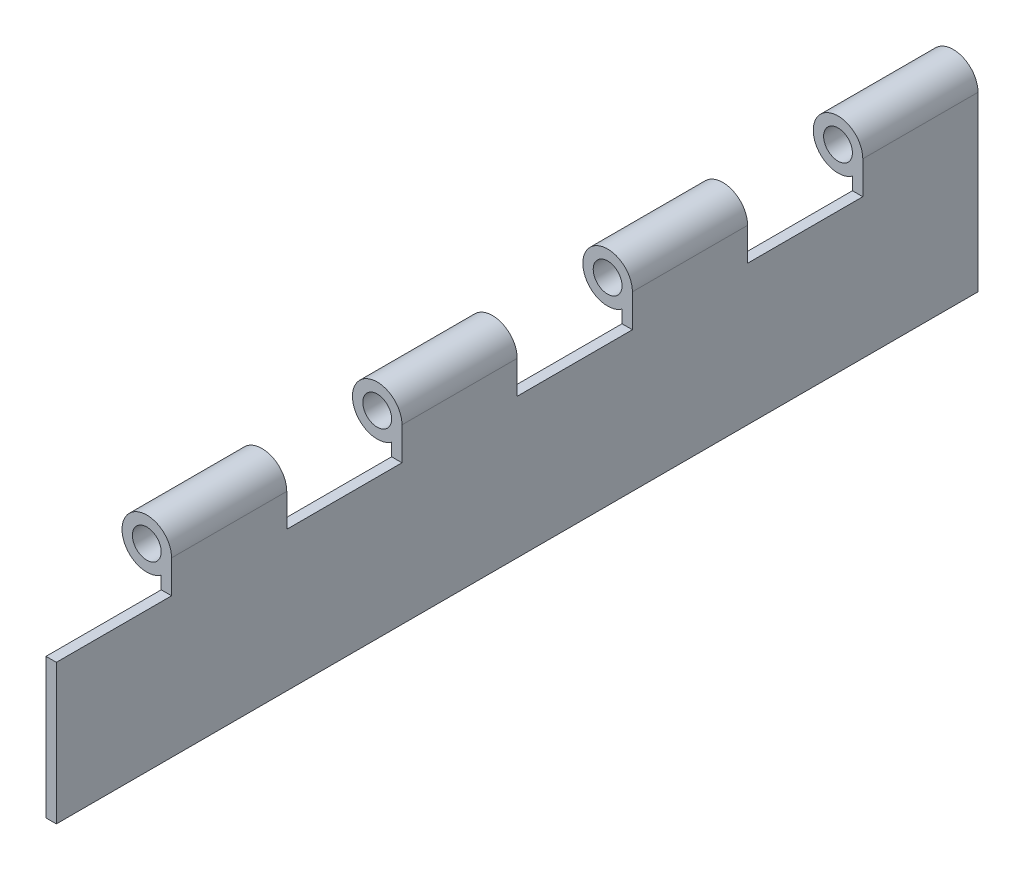
ISO-10303-21;
HEADER;
FILE_DESCRIPTION(('STEP AP214'),'2;1');
FILE_NAME('part.step','',(''),(''),'','','');
FILE_SCHEMA(('AUTOMOTIVE_DESIGN { 1 0 10303 214 1 1 1 1 }'));
ENDSEC;
DATA;
#1=APPLICATION_CONTEXT('core data for automotive mechanical design processes');
#2=APPLICATION_PROTOCOL_DEFINITION('international standard','automotive_design',2000,#1);
#3=PRODUCT_CONTEXT('',#1,'mechanical');
#4=PRODUCT('Part','Part','',(#3));
#5=PRODUCT_RELATED_PRODUCT_CATEGORY('part','',(#4));
#6=PRODUCT_DEFINITION_FORMATION('','',#4);
#7=PRODUCT_DEFINITION_CONTEXT('part definition',#1,'design');
#8=PRODUCT_DEFINITION('design','',#6,#7);
#9=PRODUCT_DEFINITION_SHAPE('','',#8);
#10=(LENGTH_UNIT() NAMED_UNIT(*) SI_UNIT(.MILLI.,.METRE.));
#11=(NAMED_UNIT(*) PLANE_ANGLE_UNIT() SI_UNIT($,.RADIAN.));
#12=(NAMED_UNIT(*) SI_UNIT($,.STERADIAN.) SOLID_ANGLE_UNIT());
#13=UNCERTAINTY_MEASURE_WITH_UNIT(LENGTH_MEASURE(1.E-05),#10,'distance_accuracy_value','');
#14=(GEOMETRIC_REPRESENTATION_CONTEXT(3) GLOBAL_UNCERTAINTY_ASSIGNED_CONTEXT((#13)) GLOBAL_UNIT_ASSIGNED_CONTEXT((#10,
#11,#12)) REPRESENTATION_CONTEXT('',''));
#15=CARTESIAN_POINT('',(0.,0.,0.));
#16=DIRECTION('',(0.,0.,1.));
#17=DIRECTION('',(1.,0.,0.));
#18=AXIS2_PLACEMENT_3D('',#15,#16,#17);
#19=CARTESIAN_POINT('',(0.,0.,203.2));
#20=DIRECTION('',(0.,0.,-1.));
#21=DIRECTION('',(-1.,0.,0.));
#22=AXIS2_PLACEMENT_3D('',#19,#20,#21);
#23=CYLINDRICAL_SURFACE('',#22,5.461);
#24=DIRECTION('',(0.,0.,-1.));
#25=VECTOR('',#24,1.);
#26=CARTESIAN_POINT('',(5.461,0.,203.2));
#27=LINE('',#26,#25);
#28=CARTESIAN_POINT('',(5.461,0.,177.8));
#29=VERTEX_POINT('',#28);
#30=CARTESIAN_POINT('',(5.461,0.,152.4));
#31=VERTEX_POINT('',#30);
#32=EDGE_CURVE('E294',#29,#31,#27,.T.);
#33=ORIENTED_EDGE('',*,*,#32,.T.);
#34=CARTESIAN_POINT('',(0.,0.,152.4));
#35=DIRECTION('',(0.,0.,1.));
#36=DIRECTION('',(1.,0.,0.));
#37=AXIS2_PLACEMENT_3D('',#34,#35,#36);
#38=CIRCLE('',#37,5.461);
#39=CARTESIAN_POINT('',(3.17500000000001,-4.44318534387211,152.4));
#40=VERTEX_POINT('',#39);
#41=EDGE_CURVE('E244',#31,#40,#38,.T.);
#42=ORIENTED_EDGE('',*,*,#41,.T.);
#43=DIRECTION('',(0.,0.,-1.));
#44=VECTOR('',#43,1.);
#45=CARTESIAN_POINT('',(3.17500000000001,-4.44318534387211,203.2));
#46=LINE('',#45,#44);
#47=CARTESIAN_POINT('',(3.17500000000001,-4.44318534387211,177.8));
#48=VERTEX_POINT('',#47);
#49=EDGE_CURVE('E11',#48,#40,#46,.T.);
#50=ORIENTED_EDGE('',*,*,#49,.F.);
#51=CARTESIAN_POINT('',(0.,0.,177.8));
#52=DIRECTION('',(0.,0.,-1.));
#53=DIRECTION('',(-1.,0.,0.));
#54=AXIS2_PLACEMENT_3D('',#51,#52,#53);
#55=CIRCLE('',#54,5.461);
#56=EDGE_CURVE('E268',#48,#29,#55,.T.);
#57=ORIENTED_EDGE('',*,*,#56,.T.);
#58=EDGE_LOOP('',(#33,#42,#50,#57));
#59=FACE_BOUND('',#58,.T.);
#60=ADVANCED_FACE('F35',(#59),#23,.T.);
#61=CARTESIAN_POINT('',(3.17500000000001,-4.44318534387211,127.));
#62=VERTEX_POINT('',#61);
#63=CARTESIAN_POINT('',(3.17500000000001,-4.44318534387211,101.6));
#64=VERTEX_POINT('',#63);
#65=EDGE_CURVE('E44',#62,#64,#46,.T.);
#66=ORIENTED_EDGE('',*,*,#65,.F.);
#67=CARTESIAN_POINT('',(0.,0.,127.));
#68=DIRECTION('',(0.,0.,-1.));
#69=DIRECTION('',(-1.,0.,0.));
#70=AXIS2_PLACEMENT_3D('',#67,#68,#69);
#71=CIRCLE('',#70,5.461);
#72=CARTESIAN_POINT('',(5.461,0.,127.));
#73=VERTEX_POINT('',#72);
#74=EDGE_CURVE('E239',#62,#73,#71,.T.);
#75=ORIENTED_EDGE('',*,*,#74,.T.);
#76=CARTESIAN_POINT('',(5.461,0.,101.6));
#77=VERTEX_POINT('',#76);
#78=EDGE_CURVE('E185',#73,#77,#27,.T.);
#79=ORIENTED_EDGE('',*,*,#78,.T.);
#80=CARTESIAN_POINT('',(0.,0.,101.6));
#81=DIRECTION('',(0.,0.,1.));
#82=DIRECTION('',(1.,0.,0.));
#83=AXIS2_PLACEMENT_3D('',#80,#81,#82);
#84=CIRCLE('',#83,5.461);
#85=EDGE_CURVE('E235',#77,#64,#84,.T.);
#86=ORIENTED_EDGE('',*,*,#85,.T.);
#87=EDGE_LOOP('',(#66,#75,#79,#86));
#88=FACE_BOUND('',#87,.T.);
#89=ADVANCED_FACE('F339',(#88),#23,.T.);
#90=CARTESIAN_POINT('',(3.17500000000001,-4.44318534387211,76.2));
#91=VERTEX_POINT('',#90);
#92=CARTESIAN_POINT('',(3.17500000000001,-4.44318534387211,50.8));
#93=VERTEX_POINT('',#92);
#94=EDGE_CURVE('E369',#91,#93,#46,.T.);
#95=ORIENTED_EDGE('',*,*,#94,.F.);
#96=CARTESIAN_POINT('',(0.,0.,76.2));
#97=DIRECTION('',(0.,0.,-1.));
#98=DIRECTION('',(-1.,0.,0.));
#99=AXIS2_PLACEMENT_3D('',#96,#97,#98);
#100=CIRCLE('',#99,5.461);
#101=CARTESIAN_POINT('',(5.461,0.,76.2));
#102=VERTEX_POINT('',#101);
#103=EDGE_CURVE('E229',#91,#102,#100,.T.);
#104=ORIENTED_EDGE('',*,*,#103,.T.);
#105=CARTESIAN_POINT('',(5.461,0.,50.8));
#106=VERTEX_POINT('',#105);
#107=EDGE_CURVE('E381',#102,#106,#27,.T.);
#108=ORIENTED_EDGE('',*,*,#107,.T.);
#109=CARTESIAN_POINT('',(0.,0.,50.8));
#110=DIRECTION('',(0.,0.,1.));
#111=DIRECTION('',(1.,0.,0.));
#112=AXIS2_PLACEMENT_3D('',#109,#110,#111);
#113=CIRCLE('',#112,5.461);
#114=EDGE_CURVE('E223',#106,#93,#113,.T.);
#115=ORIENTED_EDGE('',*,*,#114,.T.);
#116=EDGE_LOOP('',(#95,#104,#108,#115));
#117=FACE_BOUND('',#116,.T.);
#118=ADVANCED_FACE('F344',(#117),#23,.T.);
#119=CARTESIAN_POINT('',(0.,0.,203.2));
#120=DIRECTION('',(0.,0.,-1.));
#121=DIRECTION('',(-1.,0.,0.));
#122=AXIS2_PLACEMENT_3D('',#119,#120,#121);
#123=CYLINDRICAL_SURFACE('',#122,3.175);
#124=CARTESIAN_POINT('',(0.,0.,152.4));
#125=DIRECTION('',(0.,0.,1.));
#126=DIRECTION('',(1.,0.,0.));
#127=AXIS2_PLACEMENT_3D('',#124,#125,#126);
#128=CIRCLE('',#127,3.175);
#129=CARTESIAN_POINT('',(3.175,0.,152.4));
#130=VERTEX_POINT('',#129);
#131=EDGE_CURVE('E39',#130,#130,#128,.T.);
#132=ORIENTED_EDGE('',*,*,#131,.F.);
#133=EDGE_LOOP('',(#132));
#134=FACE_BOUND('',#133,.T.);
#135=CARTESIAN_POINT('',(0.,0.,177.8));
#136=DIRECTION('',(0.,0.,-1.));
#137=DIRECTION('',(-1.,0.,0.));
#138=AXIS2_PLACEMENT_3D('',#135,#136,#137);
#139=CIRCLE('',#138,3.175);
#140=CARTESIAN_POINT('',(-3.175,0.,177.8));
#141=VERTEX_POINT('',#140);
#142=EDGE_CURVE('E263',#141,#141,#139,.T.);
#143=ORIENTED_EDGE('',*,*,#142,.F.);
#144=EDGE_LOOP('',(#143));
#145=FACE_BOUND('',#144,.T.);
#146=ADVANCED_FACE('F322',(#134,#145),#123,.F.);
#147=CARTESIAN_POINT('',(0.,0.,203.2));
#148=DIRECTION('',(0.,0.,1.));
#149=DIRECTION('',(1.,0.,0.));
#150=AXIS2_PLACEMENT_3D('',#147,#148,#149);
#151=PLANE('',#150);
#152=DIRECTION('',(1.,0.,0.));
#153=VECTOR('',#152,1.);
#154=CARTESIAN_POINT('',(-5.461,-7.239,203.2));
#155=LINE('',#154,#153);
#156=CARTESIAN_POINT('',(3.17500000000001,-7.239,203.2));
#157=VERTEX_POINT('',#156);
#158=CARTESIAN_POINT('',(5.461,-7.239,203.2));
#159=VERTEX_POINT('',#158);
#160=EDGE_CURVE('E260',#157,#159,#155,.T.);
#161=ORIENTED_EDGE('',*,*,#160,.F.);
#162=DIRECTION('',(0.,-1.,0.));
#163=VECTOR('',#162,1.);
#164=CARTESIAN_POINT('',(3.17500000000001,-38.1,203.2));
#165=LINE('',#164,#163);
#166=CARTESIAN_POINT('',(3.17500000000001,-38.1,203.2));
#167=VERTEX_POINT('',#166);
#168=EDGE_CURVE('E277',#157,#167,#165,.T.);
#169=ORIENTED_EDGE('',*,*,#168,.T.);
#170=DIRECTION('',(1.,0.,0.));
#171=VECTOR('',#170,1.);
#172=CARTESIAN_POINT('',(5.461,-38.1,203.2));
#173=LINE('',#172,#171);
#174=CARTESIAN_POINT('',(5.461,-38.1,203.2));
#175=VERTEX_POINT('',#174);
#176=EDGE_CURVE('E279',#167,#175,#173,.T.);
#177=ORIENTED_EDGE('',*,*,#176,.T.);
#178=DIRECTION('',(0.,1.,0.));
#179=VECTOR('',#178,1.);
#180=CARTESIAN_POINT('',(5.461,0.,203.2));
#181=LINE('',#180,#179);
#182=EDGE_CURVE('E282',#175,#159,#181,.T.);
#183=ORIENTED_EDGE('',*,*,#182,.T.);
#184=EDGE_LOOP('',(#161,#169,#177,#183));
#185=FACE_BOUND('',#184,.T.);
#186=ADVANCED_FACE('F356',(#185),#151,.T.);
#187=CARTESIAN_POINT('',(0.,0.,0.));
#188=DIRECTION('',(0.,0.,1.));
#189=DIRECTION('',(1.,0.,0.));
#190=AXIS2_PLACEMENT_3D('',#187,#188,#189);
#191=PLANE('',#190);
#192=CARTESIAN_POINT('',(0.,0.,0.));
#193=DIRECTION('',(0.,0.,1.));
#194=DIRECTION('',(1.,0.,0.));
#195=AXIS2_PLACEMENT_3D('',#192,#193,#194);
#196=CIRCLE('',#195,5.461);
#197=CARTESIAN_POINT('',(5.461,0.,0.));
#198=VERTEX_POINT('',#197);
#199=CARTESIAN_POINT('',(3.17500000000001,-4.44318534387211,0.));
#200=VERTEX_POINT('',#199);
#201=EDGE_CURVE('E276',#198,#200,#196,.T.);
#202=ORIENTED_EDGE('',*,*,#201,.F.);
#203=DIRECTION('',(0.,1.,0.));
#204=VECTOR('',#203,1.);
#205=CARTESIAN_POINT('',(5.461,0.,0.));
#206=LINE('',#205,#204);
#207=CARTESIAN_POINT('',(5.461,-38.1,0.));
#208=VERTEX_POINT('',#207);
#209=EDGE_CURVE('E280',#208,#198,#206,.T.);
#210=ORIENTED_EDGE('',*,*,#209,.F.);
#211=DIRECTION('',(1.,0.,0.));
#212=VECTOR('',#211,1.);
#213=CARTESIAN_POINT('',(5.461,-38.1,0.));
#214=LINE('',#213,#212);
#215=CARTESIAN_POINT('',(3.17500000000001,-38.1,0.));
#216=VERTEX_POINT('',#215);
#217=EDGE_CURVE('E290',#216,#208,#214,.T.);
#218=ORIENTED_EDGE('',*,*,#217,.F.);
#219=DIRECTION('',(0.,-1.,0.));
#220=VECTOR('',#219,1.);
#221=CARTESIAN_POINT('',(3.17500000000001,-38.1,0.));
#222=LINE('',#221,#220);
#223=EDGE_CURVE('E288',#200,#216,#222,.T.);
#224=ORIENTED_EDGE('',*,*,#223,.F.);
#225=EDGE_LOOP('',(#202,#210,#218,#224));
#226=FACE_BOUND('',#225,.T.);
#227=CARTESIAN_POINT('',(0.,0.,0.));
#228=DIRECTION('',(0.,0.,1.));
#229=DIRECTION('',(1.,0.,0.));
#230=AXIS2_PLACEMENT_3D('',#227,#228,#229);
#231=CIRCLE('',#230,3.175);
#232=CARTESIAN_POINT('',(3.175,0.,0.));
#233=VERTEX_POINT('',#232);
#234=EDGE_CURVE('E273',#233,#233,#231,.T.);
#235=ORIENTED_EDGE('',*,*,#234,.T.);
#236=EDGE_LOOP('',(#235));
#237=FACE_BOUND('',#236,.T.);
#238=ADVANCED_FACE('F348',(#226,#237),#191,.F.);
#239=CARTESIAN_POINT('',(3.17500000000001,-4.44318534387211,25.4));
#240=VERTEX_POINT('',#239);
#241=EDGE_CURVE('E46',#240,#200,#46,.T.);
#242=ORIENTED_EDGE('',*,*,#241,.F.);
#243=CARTESIAN_POINT('',(0.,0.,25.4));
#244=DIRECTION('',(0.,0.,-1.));
#245=DIRECTION('',(-1.,0.,0.));
#246=AXIS2_PLACEMENT_3D('',#243,#244,#245);
#247=CIRCLE('',#246,5.461);
#248=CARTESIAN_POINT('',(5.461,0.,25.4));
#249=VERTEX_POINT('',#248);
#250=EDGE_CURVE('E217',#240,#249,#247,.T.);
#251=ORIENTED_EDGE('',*,*,#250,.T.);
#252=EDGE_CURVE('E285',#249,#198,#27,.T.);
#253=ORIENTED_EDGE('',*,*,#252,.T.);
#254=ORIENTED_EDGE('',*,*,#201,.T.);
#255=EDGE_LOOP('',(#242,#251,#253,#254));
#256=FACE_BOUND('',#255,.T.);
#257=ADVANCED_FACE('F37',(#256),#23,.T.);
#258=CARTESIAN_POINT('',(3.17500000000001,-38.1,203.2));
#259=DIRECTION('',(1.,0.,0.));
#260=DIRECTION('',(0.,1.,0.));
#261=AXIS2_PLACEMENT_3D('',#258,#259,#260);
#262=PLANE('',#261);
#263=ORIENTED_EDGE('',*,*,#49,.T.);
#264=DIRECTION('',(0.,-1.,0.));
#265=VECTOR('',#264,1.);
#266=CARTESIAN_POINT('',(3.17500000000001,-38.1,152.4));
#267=LINE('',#266,#265);
#268=CARTESIAN_POINT('',(3.17500000000001,-7.239,152.4));
#269=VERTEX_POINT('',#268);
#270=EDGE_CURVE('E241',#40,#269,#267,.T.);
#271=ORIENTED_EDGE('',*,*,#270,.T.);
#272=DIRECTION('',(0.,0.,-1.));
#273=VECTOR('',#272,1.);
#274=CARTESIAN_POINT('',(3.17500000000001,-7.239,203.2));
#275=LINE('',#274,#273);
#276=CARTESIAN_POINT('',(3.17500000000001,-7.239,127.));
#277=VERTEX_POINT('',#276);
#278=EDGE_CURVE('E252',#269,#277,#275,.T.);
#279=ORIENTED_EDGE('',*,*,#278,.T.);
#280=DIRECTION('',(0.,1.,0.));
#281=VECTOR('',#280,1.);
#282=CARTESIAN_POINT('',(3.17500000000001,-38.1,127.));
#283=LINE('',#282,#281);
#284=EDGE_CURVE('E172',#277,#62,#283,.T.);
#285=ORIENTED_EDGE('',*,*,#284,.T.);
#286=ORIENTED_EDGE('',*,*,#65,.T.);
#287=DIRECTION('',(0.,-1.,0.));
#288=VECTOR('',#287,1.);
#289=CARTESIAN_POINT('',(3.17500000000001,-38.1,101.6));
#290=LINE('',#289,#288);
#291=CARTESIAN_POINT('',(3.17500000000001,-7.239,101.6));
#292=VERTEX_POINT('',#291);
#293=EDGE_CURVE('E232',#64,#292,#290,.T.);
#294=ORIENTED_EDGE('',*,*,#293,.T.);
#295=DIRECTION('',(0.,0.,-1.));
#296=VECTOR('',#295,1.);
#297=CARTESIAN_POINT('',(3.17500000000001,-7.239,203.2));
#298=LINE('',#297,#296);
#299=CARTESIAN_POINT('',(3.17500000000001,-7.239,76.2));
#300=VERTEX_POINT('',#299);
#301=EDGE_CURVE('E249',#292,#300,#298,.T.);
#302=ORIENTED_EDGE('',*,*,#301,.T.);
#303=DIRECTION('',(0.,1.,0.));
#304=VECTOR('',#303,1.);
#305=CARTESIAN_POINT('',(3.17500000000001,-38.1,76.2));
#306=LINE('',#305,#304);
#307=EDGE_CURVE('E226',#300,#91,#306,.T.);
#308=ORIENTED_EDGE('',*,*,#307,.T.);
#309=ORIENTED_EDGE('',*,*,#94,.T.);
#310=DIRECTION('',(0.,-1.,0.));
#311=VECTOR('',#310,1.);
#312=CARTESIAN_POINT('',(3.17500000000001,-38.1,50.8));
#313=LINE('',#312,#311);
#314=CARTESIAN_POINT('',(3.17500000000001,-7.239,50.8));
#315=VERTEX_POINT('',#314);
#316=EDGE_CURVE('E220',#93,#315,#313,.T.);
#317=ORIENTED_EDGE('',*,*,#316,.T.);
#318=DIRECTION('',(0.,0.,-1.));
#319=VECTOR('',#318,1.);
#320=CARTESIAN_POINT('',(3.17500000000001,-7.239,203.2));
#321=LINE('',#320,#319);
#322=CARTESIAN_POINT('',(3.17500000000001,-7.239,25.4));
#323=VERTEX_POINT('',#322);
#324=EDGE_CURVE('E246',#315,#323,#321,.T.);
#325=ORIENTED_EDGE('',*,*,#324,.T.);
#326=DIRECTION('',(0.,1.,0.));
#327=VECTOR('',#326,1.);
#328=CARTESIAN_POINT('',(3.17500000000001,-38.1,25.4));
#329=LINE('',#328,#327);
#330=EDGE_CURVE('E214',#323,#240,#329,.T.);
#331=ORIENTED_EDGE('',*,*,#330,.T.);
#332=ORIENTED_EDGE('',*,*,#241,.T.);
#333=ORIENTED_EDGE('',*,*,#223,.T.);
#334=DIRECTION('',(0.,0.,-1.));
#335=VECTOR('',#334,1.);
#336=CARTESIAN_POINT('',(3.17500000000001,-38.1,203.2));
#337=LINE('',#336,#335);
#338=EDGE_CURVE('E300',#167,#216,#337,.T.);
#339=ORIENTED_EDGE('',*,*,#338,.F.);
#340=ORIENTED_EDGE('',*,*,#168,.F.);
#341=DIRECTION('',(0.,0.,-1.));
#342=VECTOR('',#341,1.);
#343=CARTESIAN_POINT('',(3.17500000000001,-7.239,203.2));
#344=LINE('',#343,#342);
#345=CARTESIAN_POINT('',(3.17500000000001,-7.239,177.8));
#346=VERTEX_POINT('',#345);
#347=EDGE_CURVE('E270',#157,#346,#344,.T.);
#348=ORIENTED_EDGE('',*,*,#347,.T.);
#349=DIRECTION('',(0.,1.,0.));
#350=VECTOR('',#349,1.);
#351=CARTESIAN_POINT('',(3.17500000000001,-38.1,177.8));
#352=LINE('',#351,#350);
#353=EDGE_CURVE('E265',#346,#48,#352,.T.);
#354=ORIENTED_EDGE('',*,*,#353,.T.);
#355=EDGE_LOOP('',(#263,#271,#279,#285,#286,#294,#302,#308,#309,#317,#325,#331,#332,#333,#339,
#340,#348,#354));
#356=FACE_BOUND('',#355,.T.);
#357=ADVANCED_FACE('F347',(#356),#262,.F.);
#358=CARTESIAN_POINT('',(5.461,-38.1,203.2));
#359=DIRECTION('',(0.,1.,0.));
#360=DIRECTION('',(0.,0.,1.));
#361=AXIS2_PLACEMENT_3D('',#358,#359,#360);
#362=PLANE('',#361);
#363=ORIENTED_EDGE('',*,*,#217,.T.);
#364=DIRECTION('',(0.,0.,-1.));
#365=VECTOR('',#364,1.);
#366=CARTESIAN_POINT('',(5.461,-38.1,203.2));
#367=LINE('',#366,#365);
#368=EDGE_CURVE('E297',#175,#208,#367,.T.);
#369=ORIENTED_EDGE('',*,*,#368,.F.);
#370=ORIENTED_EDGE('',*,*,#176,.F.);
#371=ORIENTED_EDGE('',*,*,#338,.T.);
#372=EDGE_LOOP('',(#363,#369,#370,#371));
#373=FACE_BOUND('',#372,.T.);
#374=ADVANCED_FACE('F354',(#373),#362,.F.);
#375=CARTESIAN_POINT('',(5.461,0.,203.2));
#376=DIRECTION('',(-1.,0.,0.));
#377=DIRECTION('',(0.,-1.,0.));
#378=AXIS2_PLACEMENT_3D('',#375,#376,#377);
#379=PLANE('',#378);
#380=DIRECTION('',(0.,0.,-1.));
#381=VECTOR('',#380,1.);
#382=CARTESIAN_POINT('',(5.461,-7.239,152.4));
#383=LINE('',#382,#381);
#384=CARTESIAN_POINT('',(5.461,-7.239,152.4));
#385=VERTEX_POINT('',#384);
#386=CARTESIAN_POINT('',(5.461,-7.239,127.));
#387=VERTEX_POINT('',#386);
#388=EDGE_CURVE('E179',#385,#387,#383,.T.);
#389=ORIENTED_EDGE('',*,*,#388,.F.);
#390=DIRECTION('',(0.,-1.,0.));
#391=VECTOR('',#390,1.);
#392=CARTESIAN_POINT('',(5.461,5.461,152.4));
#393=LINE('',#392,#391);
#394=EDGE_CURVE('E53',#31,#385,#393,.T.);
#395=ORIENTED_EDGE('',*,*,#394,.F.);
#396=ORIENTED_EDGE('',*,*,#32,.F.);
#397=DIRECTION('',(0.,1.,0.));
#398=VECTOR('',#397,1.);
#399=CARTESIAN_POINT('',(5.461,5.461,177.8));
#400=LINE('',#399,#398);
#401=CARTESIAN_POINT('',(5.461,-7.239,177.8));
#402=VERTEX_POINT('',#401);
#403=EDGE_CURVE('E257',#402,#29,#400,.T.);
#404=ORIENTED_EDGE('',*,*,#403,.F.);
#405=DIRECTION('',(0.,0.,-1.));
#406=VECTOR('',#405,1.);
#407=CARTESIAN_POINT('',(5.461,-7.239,203.2));
#408=LINE('',#407,#406);
#409=EDGE_CURVE('E254',#159,#402,#408,.T.);
#410=ORIENTED_EDGE('',*,*,#409,.F.);
#411=ORIENTED_EDGE('',*,*,#182,.F.);
#412=ORIENTED_EDGE('',*,*,#368,.T.);
#413=ORIENTED_EDGE('',*,*,#209,.T.);
#414=ORIENTED_EDGE('',*,*,#252,.F.);
#415=DIRECTION('',(0.,1.,0.));
#416=VECTOR('',#415,1.);
#417=CARTESIAN_POINT('',(5.461,5.461,25.4));
#418=LINE('',#417,#416);
#419=CARTESIAN_POINT('',(5.461,-7.239,25.4));
#420=VERTEX_POINT('',#419);
#421=EDGE_CURVE('E207',#420,#249,#418,.T.);
#422=ORIENTED_EDGE('',*,*,#421,.F.);
#423=DIRECTION('',(0.,0.,-1.));
#424=VECTOR('',#423,1.);
#425=CARTESIAN_POINT('',(5.461,-7.239,50.8));
#426=LINE('',#425,#424);
#427=CARTESIAN_POINT('',(5.461,-7.239,50.8));
#428=VERTEX_POINT('',#427);
#429=EDGE_CURVE('E204',#428,#420,#426,.T.);
#430=ORIENTED_EDGE('',*,*,#429,.F.);
#431=DIRECTION('',(0.,-1.,0.));
#432=VECTOR('',#431,1.);
#433=CARTESIAN_POINT('',(5.461,5.461,50.8));
#434=LINE('',#433,#432);
#435=EDGE_CURVE('E202',#106,#428,#434,.T.);
#436=ORIENTED_EDGE('',*,*,#435,.F.);
#437=ORIENTED_EDGE('',*,*,#107,.F.);
#438=DIRECTION('',(0.,1.,0.));
#439=VECTOR('',#438,1.);
#440=CARTESIAN_POINT('',(5.461,5.461,76.2));
#441=LINE('',#440,#439);
#442=CARTESIAN_POINT('',(5.461,-7.239,76.2));
#443=VERTEX_POINT('',#442);
#444=EDGE_CURVE('E195',#443,#102,#441,.T.);
#445=ORIENTED_EDGE('',*,*,#444,.F.);
#446=DIRECTION('',(0.,0.,-1.));
#447=VECTOR('',#446,1.);
#448=CARTESIAN_POINT('',(5.461,-7.239,101.6));
#449=LINE('',#448,#447);
#450=CARTESIAN_POINT('',(5.461,-7.239,101.6));
#451=VERTEX_POINT('',#450);
#452=EDGE_CURVE('E191',#451,#443,#449,.T.);
#453=ORIENTED_EDGE('',*,*,#452,.F.);
#454=DIRECTION('',(0.,-1.,0.));
#455=VECTOR('',#454,1.);
#456=CARTESIAN_POINT('',(5.461,5.461,101.6));
#457=LINE('',#456,#455);
#458=EDGE_CURVE('E61',#77,#451,#457,.T.);
#459=ORIENTED_EDGE('',*,*,#458,.F.);
#460=ORIENTED_EDGE('',*,*,#78,.F.);
#461=DIRECTION('',(0.,1.,0.));
#462=VECTOR('',#461,1.);
#463=CARTESIAN_POINT('',(5.461,5.461,127.));
#464=LINE('',#463,#462);
#465=EDGE_CURVE('E169',#387,#73,#464,.T.);
#466=ORIENTED_EDGE('',*,*,#465,.F.);
#467=EDGE_LOOP('',(#389,#395,#396,#404,#410,#411,#412,#413,#414,#422,#430,#436,#437,#445,#453,
#459,#460,#466));
#468=FACE_BOUND('',#467,.T.);
#469=ADVANCED_FACE('F183',(#468),#379,.F.);
#470=CARTESIAN_POINT('',(0.,0.,25.4));
#471=DIRECTION('',(0.,0.,-1.));
#472=DIRECTION('',(-1.,0.,0.));
#473=AXIS2_PLACEMENT_3D('',#470,#471,#472);
#474=CIRCLE('',#473,3.175);
#475=CARTESIAN_POINT('',(-3.175,0.,25.4));
#476=VERTEX_POINT('',#475);
#477=EDGE_CURVE('E175',#476,#476,#474,.T.);
#478=ORIENTED_EDGE('',*,*,#477,.F.);
#479=EDGE_LOOP('',(#478));
#480=FACE_BOUND('',#479,.T.);
#481=ORIENTED_EDGE('',*,*,#234,.F.);
#482=EDGE_LOOP('',(#481));
#483=FACE_BOUND('',#482,.T.);
#484=ADVANCED_FACE('F366',(#480,#483),#123,.F.);
#485=CARTESIAN_POINT('',(-5.461,-7.239,203.2));
#486=DIRECTION('',(0.,-1.,0.));
#487=DIRECTION('',(1.,0.,0.));
#488=AXIS2_PLACEMENT_3D('',#485,#486,#487);
#489=PLANE('',#488);
#490=ORIENTED_EDGE('',*,*,#160,.T.);
#491=ORIENTED_EDGE('',*,*,#409,.T.);
#492=DIRECTION('',(1.,0.,0.));
#493=VECTOR('',#492,1.);
#494=CARTESIAN_POINT('',(-5.461,-7.239,177.8));
#495=LINE('',#494,#493);
#496=EDGE_CURVE('E261',#346,#402,#495,.T.);
#497=ORIENTED_EDGE('',*,*,#496,.F.);
#498=ORIENTED_EDGE('',*,*,#347,.F.);
#499=EDGE_LOOP('',(#490,#491,#497,#498));
#500=FACE_BOUND('',#499,.T.);
#501=ADVANCED_FACE('F391',(#500),#489,.F.);
#502=CARTESIAN_POINT('',(-5.461,5.461,177.8));
#503=DIRECTION('',(0.,0.,-1.));
#504=DIRECTION('',(-1.,0.,0.));
#505=AXIS2_PLACEMENT_3D('',#502,#503,#504);
#506=PLANE('',#505);
#507=ORIENTED_EDGE('',*,*,#142,.T.);
#508=EDGE_LOOP('',(#507));
#509=FACE_BOUND('',#508,.T.);
#510=ORIENTED_EDGE('',*,*,#56,.F.);
#511=ORIENTED_EDGE('',*,*,#353,.F.);
#512=ORIENTED_EDGE('',*,*,#496,.T.);
#513=ORIENTED_EDGE('',*,*,#403,.T.);
#514=EDGE_LOOP('',(#510,#511,#512,#513));
#515=FACE_BOUND('',#514,.T.);
#516=ADVANCED_FACE('F396',(#509,#515),#506,.F.);
#517=CARTESIAN_POINT('',(-5.46100000000001,-7.239,50.8));
#518=DIRECTION('',(0.,-1.,0.));
#519=DIRECTION('',(1.,0.,0.));
#520=AXIS2_PLACEMENT_3D('',#517,#518,#519);
#521=PLANE('',#520);
#522=DIRECTION('',(1.,0.,0.));
#523=VECTOR('',#522,1.);
#524=CARTESIAN_POINT('',(-5.46100000000001,-7.239,50.8));
#525=LINE('',#524,#523);
#526=EDGE_CURVE('E210',#315,#428,#525,.T.);
#527=ORIENTED_EDGE('',*,*,#526,.T.);
#528=ORIENTED_EDGE('',*,*,#429,.T.);
#529=DIRECTION('',(1.,0.,0.));
#530=VECTOR('',#529,1.);
#531=CARTESIAN_POINT('',(-5.46100000000001,-7.239,25.4));
#532=LINE('',#531,#530);
#533=EDGE_CURVE('E192',#323,#420,#532,.T.);
#534=ORIENTED_EDGE('',*,*,#533,.F.);
#535=ORIENTED_EDGE('',*,*,#324,.F.);
#536=EDGE_LOOP('',(#527,#528,#534,#535));
#537=FACE_BOUND('',#536,.T.);
#538=ADVANCED_FACE('F413',(#537),#521,.F.);
#539=CARTESIAN_POINT('',(-5.46100000000001,5.461,50.8));
#540=DIRECTION('',(0.,0.,1.));
#541=DIRECTION('',(1.,0.,0.));
#542=AXIS2_PLACEMENT_3D('',#539,#540,#541);
#543=PLANE('',#542);
#544=CARTESIAN_POINT('',(0.,0.,50.8));
#545=DIRECTION('',(0.,0.,1.));
#546=DIRECTION('',(1.,0.,0.));
#547=AXIS2_PLACEMENT_3D('',#544,#545,#546);
#548=CIRCLE('',#547,3.175);
#549=CARTESIAN_POINT('',(3.175,0.,50.8));
#550=VERTEX_POINT('',#549);
#551=EDGE_CURVE('E219',#550,#550,#548,.T.);
#552=ORIENTED_EDGE('',*,*,#551,.T.);
#553=EDGE_LOOP('',(#552));
#554=FACE_BOUND('',#553,.T.);
#555=ORIENTED_EDGE('',*,*,#435,.T.);
#556=ORIENTED_EDGE('',*,*,#526,.F.);
#557=ORIENTED_EDGE('',*,*,#316,.F.);
#558=ORIENTED_EDGE('',*,*,#114,.F.);
#559=EDGE_LOOP('',(#555,#556,#557,#558));
#560=FACE_BOUND('',#559,.T.);
#561=ADVANCED_FACE('F411',(#554,#560),#543,.F.);
#562=CARTESIAN_POINT('',(-5.46100000000001,5.461,25.4));
#563=DIRECTION('',(0.,0.,-1.));
#564=DIRECTION('',(-1.,0.,0.));
#565=AXIS2_PLACEMENT_3D('',#562,#563,#564);
#566=PLANE('',#565);
#567=ORIENTED_EDGE('',*,*,#477,.T.);
#568=EDGE_LOOP('',(#567));
#569=FACE_BOUND('',#568,.T.);
#570=ORIENTED_EDGE('',*,*,#250,.F.);
#571=ORIENTED_EDGE('',*,*,#330,.F.);
#572=ORIENTED_EDGE('',*,*,#533,.T.);
#573=ORIENTED_EDGE('',*,*,#421,.T.);
#574=EDGE_LOOP('',(#570,#571,#572,#573));
#575=FACE_BOUND('',#574,.T.);
#576=ADVANCED_FACE('F416',(#569,#575),#566,.F.);
#577=CARTESIAN_POINT('',(0.,0.,76.2));
#578=DIRECTION('',(0.,0.,-1.));
#579=DIRECTION('',(-1.,0.,0.));
#580=AXIS2_PLACEMENT_3D('',#577,#578,#579);
#581=CIRCLE('',#580,3.175);
#582=CARTESIAN_POINT('',(-3.175,0.,76.2));
#583=VERTEX_POINT('',#582);
#584=EDGE_CURVE('E225',#583,#583,#581,.T.);
#585=ORIENTED_EDGE('',*,*,#584,.F.);
#586=EDGE_LOOP('',(#585));
#587=FACE_BOUND('',#586,.T.);
#588=ORIENTED_EDGE('',*,*,#551,.F.);
#589=EDGE_LOOP('',(#588));
#590=FACE_BOUND('',#589,.T.);
#591=ADVANCED_FACE('F321',(#587,#590),#123,.F.);
#592=CARTESIAN_POINT('',(-5.46100000000001,-7.239,101.6));
#593=DIRECTION('',(0.,-1.,0.));
#594=DIRECTION('',(1.,0.,0.));
#595=AXIS2_PLACEMENT_3D('',#592,#593,#594);
#596=PLANE('',#595);
#597=DIRECTION('',(1.,0.,0.));
#598=VECTOR('',#597,1.);
#599=CARTESIAN_POINT('',(-5.46100000000001,-7.239,101.6));
#600=LINE('',#599,#598);
#601=EDGE_CURVE('E198',#292,#451,#600,.T.);
#602=ORIENTED_EDGE('',*,*,#601,.T.);
#603=ORIENTED_EDGE('',*,*,#452,.T.);
#604=DIRECTION('',(1.,0.,0.));
#605=VECTOR('',#604,1.);
#606=CARTESIAN_POINT('',(-5.46100000000001,-7.239,76.2));
#607=LINE('',#606,#605);
#608=EDGE_CURVE('E199',#300,#443,#607,.T.);
#609=ORIENTED_EDGE('',*,*,#608,.F.);
#610=ORIENTED_EDGE('',*,*,#301,.F.);
#611=EDGE_LOOP('',(#602,#603,#609,#610));
#612=FACE_BOUND('',#611,.T.);
#613=ADVANCED_FACE('F327',(#612),#596,.F.);
#614=CARTESIAN_POINT('',(-5.46100000000001,5.461,101.6));
#615=DIRECTION('',(0.,0.,1.));
#616=DIRECTION('',(1.,0.,0.));
#617=AXIS2_PLACEMENT_3D('',#614,#615,#616);
#618=PLANE('',#617);
#619=CARTESIAN_POINT('',(0.,0.,101.6));
#620=DIRECTION('',(0.,0.,1.));
#621=DIRECTION('',(1.,0.,0.));
#622=AXIS2_PLACEMENT_3D('',#619,#620,#621);
#623=CIRCLE('',#622,3.175);
#624=CARTESIAN_POINT('',(3.175,0.,101.6));
#625=VERTEX_POINT('',#624);
#626=EDGE_CURVE('E231',#625,#625,#623,.T.);
#627=ORIENTED_EDGE('',*,*,#626,.T.);
#628=EDGE_LOOP('',(#627));
#629=FACE_BOUND('',#628,.T.);
#630=ORIENTED_EDGE('',*,*,#458,.T.);
#631=ORIENTED_EDGE('',*,*,#601,.F.);
#632=ORIENTED_EDGE('',*,*,#293,.F.);
#633=ORIENTED_EDGE('',*,*,#85,.F.);
#634=EDGE_LOOP('',(#630,#631,#632,#633));
#635=FACE_BOUND('',#634,.T.);
#636=ADVANCED_FACE('F325',(#629,#635),#618,.F.);
#637=CARTESIAN_POINT('',(-5.46100000000001,5.461,76.2));
#638=DIRECTION('',(0.,0.,-1.));
#639=DIRECTION('',(-1.,0.,0.));
#640=AXIS2_PLACEMENT_3D('',#637,#638,#639);
#641=PLANE('',#640);
#642=ORIENTED_EDGE('',*,*,#584,.T.);
#643=EDGE_LOOP('',(#642));
#644=FACE_BOUND('',#643,.T.);
#645=ORIENTED_EDGE('',*,*,#103,.F.);
#646=ORIENTED_EDGE('',*,*,#307,.F.);
#647=ORIENTED_EDGE('',*,*,#608,.T.);
#648=ORIENTED_EDGE('',*,*,#444,.T.);
#649=EDGE_LOOP('',(#645,#646,#647,#648));
#650=FACE_BOUND('',#649,.T.);
#651=ADVANCED_FACE('F319',(#644,#650),#641,.F.);
#652=CARTESIAN_POINT('',(0.,0.,127.));
#653=DIRECTION('',(0.,0.,-1.));
#654=DIRECTION('',(-1.,0.,0.));
#655=AXIS2_PLACEMENT_3D('',#652,#653,#654);
#656=CIRCLE('',#655,3.175);
#657=CARTESIAN_POINT('',(-3.175,0.,127.));
#658=VERTEX_POINT('',#657);
#659=EDGE_CURVE('E237',#658,#658,#656,.T.);
#660=ORIENTED_EDGE('',*,*,#659,.F.);
#661=EDGE_LOOP('',(#660));
#662=FACE_BOUND('',#661,.T.);
#663=ORIENTED_EDGE('',*,*,#626,.F.);
#664=EDGE_LOOP('',(#663));
#665=FACE_BOUND('',#664,.T.);
#666=ADVANCED_FACE('F316',(#662,#665),#123,.F.);
#667=CARTESIAN_POINT('',(-5.46100000000001,-7.239,152.4));
#668=DIRECTION('',(0.,-1.,0.));
#669=DIRECTION('',(1.,0.,0.));
#670=AXIS2_PLACEMENT_3D('',#667,#668,#669);
#671=PLANE('',#670);
#672=DIRECTION('',(1.,0.,0.));
#673=VECTOR('',#672,1.);
#674=CARTESIAN_POINT('',(-5.46100000000001,-7.239,152.4));
#675=LINE('',#674,#673);
#676=EDGE_CURVE('E176',#269,#385,#675,.T.);
#677=ORIENTED_EDGE('',*,*,#676,.T.);
#678=ORIENTED_EDGE('',*,*,#388,.T.);
#679=DIRECTION('',(1.,0.,0.));
#680=VECTOR('',#679,1.);
#681=CARTESIAN_POINT('',(-5.46100000000001,-7.239,127.));
#682=LINE('',#681,#680);
#683=EDGE_CURVE('E165',#277,#387,#682,.T.);
#684=ORIENTED_EDGE('',*,*,#683,.F.);
#685=ORIENTED_EDGE('',*,*,#278,.F.);
#686=EDGE_LOOP('',(#677,#678,#684,#685));
#687=FACE_BOUND('',#686,.T.);
#688=ADVANCED_FACE('F180',(#687),#671,.F.);
#689=CARTESIAN_POINT('',(-5.46100000000001,5.461,152.4));
#690=DIRECTION('',(0.,0.,1.));
#691=DIRECTION('',(1.,0.,0.));
#692=AXIS2_PLACEMENT_3D('',#689,#690,#691);
#693=PLANE('',#692);
#694=ORIENTED_EDGE('',*,*,#131,.T.);
#695=EDGE_LOOP('',(#694));
#696=FACE_BOUND('',#695,.T.);
#697=ORIENTED_EDGE('',*,*,#394,.T.);
#698=ORIENTED_EDGE('',*,*,#676,.F.);
#699=ORIENTED_EDGE('',*,*,#270,.F.);
#700=ORIENTED_EDGE('',*,*,#41,.F.);
#701=EDGE_LOOP('',(#697,#698,#699,#700));
#702=FACE_BOUND('',#701,.T.);
#703=ADVANCED_FACE('F399',(#696,#702),#693,.F.);
#704=CARTESIAN_POINT('',(-5.46100000000001,5.461,127.));
#705=DIRECTION('',(0.,0.,-1.));
#706=DIRECTION('',(-1.,0.,0.));
#707=AXIS2_PLACEMENT_3D('',#704,#705,#706);
#708=PLANE('',#707);
#709=ORIENTED_EDGE('',*,*,#659,.T.);
#710=EDGE_LOOP('',(#709));
#711=FACE_BOUND('',#710,.T.);
#712=ORIENTED_EDGE('',*,*,#74,.F.);
#713=ORIENTED_EDGE('',*,*,#284,.F.);
#714=ORIENTED_EDGE('',*,*,#683,.T.);
#715=ORIENTED_EDGE('',*,*,#465,.T.);
#716=EDGE_LOOP('',(#712,#713,#714,#715));
#717=FACE_BOUND('',#716,.T.);
#718=ADVANCED_FACE('F167',(#711,#717),#708,.F.);
#719=CLOSED_SHELL('',(#60,#89,#118,#146,#186,#238,#257,#357,#374,#469,#484,#501,#516,#538,#561,
#576,#591,#613,#636,#651,#666,#688,#703,#718));
#720=MANIFOLD_SOLID_BREP('B2',#719);
#721=ADVANCED_BREP_SHAPE_REPRESENTATION('',(#18,#720),#14);
#722=SHAPE_DEFINITION_REPRESENTATION(#9,#721);
ENDSEC;
END-ISO-10303-21;
